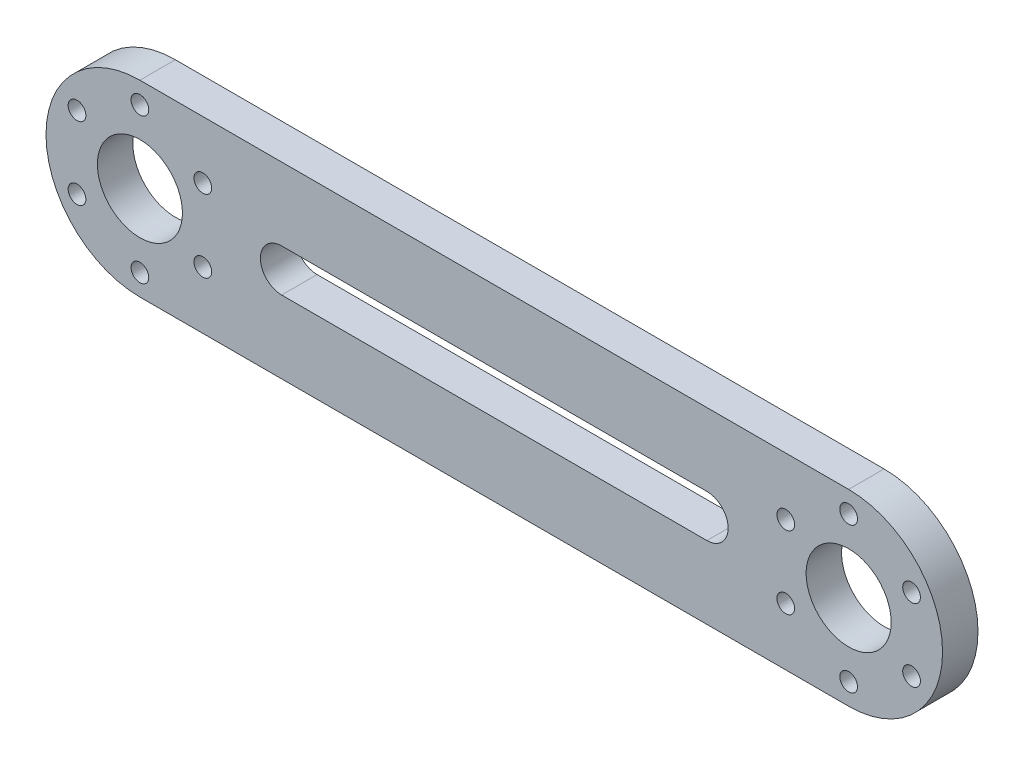
ISO-10303-21;
HEADER;
FILE_DESCRIPTION(('STEP AP214'),'2;1');
FILE_NAME('part.step','',(''),(''),'','','');
FILE_SCHEMA(('AUTOMOTIVE_DESIGN { 1 0 10303 214 1 1 1 1 }'));
ENDSEC;
DATA;
#1=APPLICATION_CONTEXT('core data for automotive mechanical design processes');
#2=APPLICATION_PROTOCOL_DEFINITION('international standard','automotive_design',2000,#1);
#3=PRODUCT_CONTEXT('',#1,'mechanical');
#4=PRODUCT('Part','Part','',(#3));
#5=PRODUCT_RELATED_PRODUCT_CATEGORY('part','',(#4));
#6=PRODUCT_DEFINITION_FORMATION('','',#4);
#7=PRODUCT_DEFINITION_CONTEXT('part definition',#1,'design');
#8=PRODUCT_DEFINITION('design','',#6,#7);
#9=PRODUCT_DEFINITION_SHAPE('','',#8);
#10=(LENGTH_UNIT() NAMED_UNIT(*) SI_UNIT(.MILLI.,.METRE.));
#11=(NAMED_UNIT(*) PLANE_ANGLE_UNIT() SI_UNIT($,.RADIAN.));
#12=(NAMED_UNIT(*) SI_UNIT($,.STERADIAN.) SOLID_ANGLE_UNIT());
#13=UNCERTAINTY_MEASURE_WITH_UNIT(LENGTH_MEASURE(1.E-05),#10,'distance_accuracy_value','');
#14=(GEOMETRIC_REPRESENTATION_CONTEXT(3) GLOBAL_UNCERTAINTY_ASSIGNED_CONTEXT((#13)) GLOBAL_UNIT_ASSIGNED_CONTEXT((#10,
#11,#12)) REPRESENTATION_CONTEXT('',''));
#15=CARTESIAN_POINT('',(0.,0.,0.));
#16=DIRECTION('',(0.,0.,1.));
#17=DIRECTION('',(1.,0.,0.));
#18=AXIS2_PLACEMENT_3D('',#15,#16,#17);
#19=CARTESIAN_POINT('',(0.,0.,4.99999999999999));
#20=DIRECTION('',(0.,0.,1.));
#21=DIRECTION('',(1.,0.,0.));
#22=AXIS2_PLACEMENT_3D('',#19,#20,#21);
#23=PLANE('',#22);
#24=CARTESIAN_POINT('',(91.1232396112095,5.12499999999991,5.00000000000005));
#25=DIRECTION('',(0.,0.,-1.));
#26=DIRECTION('',(-1.,0.,0.));
#27=AXIS2_PLACEMENT_3D('',#24,#25,#26);
#28=CIRCLE('',#27,1.25000000000001);
#29=CARTESIAN_POINT('',(89.8732396112095,5.12499999999991,5.00000000000005));
#30=VERTEX_POINT('',#29);
#31=EDGE_CURVE('E316',#30,#30,#28,.T.);
#32=ORIENTED_EDGE('',*,*,#31,.T.);
#33=EDGE_LOOP('',(#32));
#34=FACE_BOUND('',#33,.T.);
#35=CARTESIAN_POINT('',(108.876760388791,5.12499999999988,5.00000000000001));
#36=DIRECTION('',(0.,0.,1.));
#37=DIRECTION('',(1.,0.,0.));
#38=AXIS2_PLACEMENT_3D('',#35,#36,#37);
#39=CIRCLE('',#38,1.25000000000001);
#40=CARTESIAN_POINT('',(110.126760388791,5.12499999999988,5.00000000000001));
#41=VERTEX_POINT('',#40);
#42=EDGE_CURVE('E348',#41,#41,#39,.F.);
#43=ORIENTED_EDGE('',*,*,#42,.T.);
#44=EDGE_LOOP('',(#43));
#45=FACE_BOUND('',#44,.T.);
#46=CARTESIAN_POINT('',(108.876760388791,-5.12499999999991,5.));
#47=DIRECTION('',(0.,0.,-1.));
#48=DIRECTION('',(-1.,0.,0.));
#49=AXIS2_PLACEMENT_3D('',#46,#47,#48);
#50=CIRCLE('',#49,1.25000000000001);
#51=CARTESIAN_POINT('',(107.626760388791,-5.12499999999991,5.));
#52=VERTEX_POINT('',#51);
#53=EDGE_CURVE('E331',#52,#52,#50,.T.);
#54=ORIENTED_EDGE('',*,*,#53,.T.);
#55=EDGE_LOOP('',(#54));
#56=FACE_BOUND('',#55,.T.);
#57=CARTESIAN_POINT('',(100.,-10.25,5.00000000000005));
#58=DIRECTION('',(0.,0.,-1.));
#59=DIRECTION('',(-1.,0.,0.));
#60=AXIS2_PLACEMENT_3D('',#57,#58,#59);
#61=CIRCLE('',#60,1.25);
#62=CARTESIAN_POINT('',(98.75,-10.25,5.00000000000005));
#63=VERTEX_POINT('',#62);
#64=EDGE_CURVE('E458',#63,#63,#61,.T.);
#65=ORIENTED_EDGE('',*,*,#64,.T.);
#66=EDGE_LOOP('',(#65));
#67=FACE_BOUND('',#66,.T.);
#68=CARTESIAN_POINT('',(91.1232396112095,-5.12499999999991,5.00000000000001));
#69=DIRECTION('',(0.,0.,-1.));
#70=DIRECTION('',(-1.,0.,0.));
#71=AXIS2_PLACEMENT_3D('',#68,#69,#70);
#72=CIRCLE('',#71,1.25000000000001);
#73=CARTESIAN_POINT('',(89.8732396112095,-5.12499999999991,5.00000000000001));
#74=VERTEX_POINT('',#73);
#75=EDGE_CURVE('E450',#74,#74,#72,.T.);
#76=ORIENTED_EDGE('',*,*,#75,.T.);
#77=EDGE_LOOP('',(#76));
#78=FACE_BOUND('',#77,.T.);
#79=CARTESIAN_POINT('',(100.,10.25,5.00000000000003));
#80=DIRECTION('',(0.,0.,1.));
#81=DIRECTION('',(1.,0.,0.));
#82=AXIS2_PLACEMENT_3D('',#79,#80,#81);
#83=CIRCLE('',#82,1.25);
#84=CARTESIAN_POINT('',(101.25,10.25,5.00000000000003));
#85=VERTEX_POINT('',#84);
#86=EDGE_CURVE('E284',#85,#85,#83,.F.);
#87=ORIENTED_EDGE('',*,*,#86,.T.);
#88=EDGE_LOOP('',(#87));
#89=FACE_BOUND('',#88,.T.);
#90=CARTESIAN_POINT('',(0.,0.,4.99999999999999));
#91=DIRECTION('',(0.,0.,1.));
#92=DIRECTION('',(1.,0.,0.));
#93=AXIS2_PLACEMENT_3D('',#90,#91,#92);
#94=CIRCLE('',#93,6.);
#95=CARTESIAN_POINT('',(6.,0.,4.99999999999999));
#96=VERTEX_POINT('',#95);
#97=EDGE_CURVE('E190',#96,#96,#94,.T.);
#98=ORIENTED_EDGE('',*,*,#97,.F.);
#99=EDGE_LOOP('',(#98));
#100=FACE_BOUND('',#99,.T.);
#101=CARTESIAN_POINT('',(0.,0.,4.99999999999999));
#102=DIRECTION('',(0.,0.,1.));
#103=DIRECTION('',(1.,0.,0.));
#104=AXIS2_PLACEMENT_3D('',#101,#102,#103);
#105=CIRCLE('',#104,13.25);
#106=CARTESIAN_POINT('',(0.,13.25,5.));
#107=VERTEX_POINT('',#106);
#108=CARTESIAN_POINT('',(0.,-13.25,5.));
#109=VERTEX_POINT('',#108);
#110=EDGE_CURVE('E278',#107,#109,#105,.T.);
#111=ORIENTED_EDGE('',*,*,#110,.T.);
#112=DIRECTION('',(1.,0.,0.));
#113=VECTOR('',#112,1.);
#114=CARTESIAN_POINT('',(0.,-13.25,5.));
#115=LINE('',#114,#113);
#116=CARTESIAN_POINT('',(100.,-13.25,5.));
#117=VERTEX_POINT('',#116);
#118=EDGE_CURVE('E109',#109,#117,#115,.T.);
#119=ORIENTED_EDGE('',*,*,#118,.T.);
#120=CARTESIAN_POINT('',(100.,0.,5.00000000000003));
#121=DIRECTION('',(0.,0.,1.));
#122=DIRECTION('',(1.,0.,0.));
#123=AXIS2_PLACEMENT_3D('',#120,#121,#122);
#124=CIRCLE('',#123,13.25);
#125=CARTESIAN_POINT('',(100.,13.25,5.00000000000002));
#126=VERTEX_POINT('',#125);
#127=EDGE_CURVE('E289',#117,#126,#124,.T.);
#128=ORIENTED_EDGE('',*,*,#127,.T.);
#129=DIRECTION('',(1.,0.,0.));
#130=VECTOR('',#129,1.);
#131=CARTESIAN_POINT('',(0.,13.25,5.));
#132=LINE('',#131,#130);
#133=EDGE_CURVE('E223',#107,#126,#132,.T.);
#134=ORIENTED_EDGE('',*,*,#133,.F.);
#135=EDGE_LOOP('',(#111,#119,#128,#134));
#136=FACE_BOUND('',#135,.T.);
#137=CARTESIAN_POINT('',(80.,0.,5.00000000000002));
#138=DIRECTION('',(0.,0.,1.));
#139=DIRECTION('',(1.,0.,0.));
#140=AXIS2_PLACEMENT_3D('',#137,#138,#139);
#141=CIRCLE('',#140,2.99999999999999);
#142=CARTESIAN_POINT('',(80.,-2.99999999999998,5.00000000000003));
#143=VERTEX_POINT('',#142);
#144=CARTESIAN_POINT('',(80.,2.99999999999998,5.00000000000007));
#145=VERTEX_POINT('',#144);
#146=EDGE_CURVE('E138',#143,#145,#141,.T.);
#147=ORIENTED_EDGE('',*,*,#146,.F.);
#148=DIRECTION('',(1.,0.,0.));
#149=VECTOR('',#148,1.);
#150=CARTESIAN_POINT('',(0.,-3.,4.99999999999999));
#151=LINE('',#150,#149);
#152=CARTESIAN_POINT('',(20.,-3.00000000000003,5.00000000000001));
#153=VERTEX_POINT('',#152);
#154=EDGE_CURVE('E127',#153,#143,#151,.T.);
#155=ORIENTED_EDGE('',*,*,#154,.F.);
#156=CARTESIAN_POINT('',(20.,0.,5.));
#157=DIRECTION('',(0.,0.,1.));
#158=DIRECTION('',(1.,0.,0.));
#159=AXIS2_PLACEMENT_3D('',#156,#157,#158);
#160=CIRCLE('',#159,3.);
#161=CARTESIAN_POINT('',(20.,2.99999999999998,5.00000000000002));
#162=VERTEX_POINT('',#161);
#163=EDGE_CURVE('E137',#162,#153,#160,.T.);
#164=ORIENTED_EDGE('',*,*,#163,.F.);
#165=DIRECTION('',(1.,0.,0.));
#166=VECTOR('',#165,1.);
#167=CARTESIAN_POINT('',(0.,2.99999999999998,5.00000000000003));
#168=LINE('',#167,#166);
#169=EDGE_CURVE('E67',#162,#145,#168,.T.);
#170=ORIENTED_EDGE('',*,*,#169,.T.);
#171=EDGE_LOOP('',(#147,#155,#164,#170));
#172=FACE_BOUND('',#171,.T.);
#173=CARTESIAN_POINT('',(100.,0.,5.00000000000003));
#174=DIRECTION('',(0.,0.,1.));
#175=DIRECTION('',(1.,0.,0.));
#176=AXIS2_PLACEMENT_3D('',#173,#174,#175);
#177=CIRCLE('',#176,6.);
#178=CARTESIAN_POINT('',(106.,0.,5.00000000000003));
#179=VERTEX_POINT('',#178);
#180=EDGE_CURVE('E146',#179,#179,#177,.T.);
#181=ORIENTED_EDGE('',*,*,#180,.F.);
#182=EDGE_LOOP('',(#181));
#183=FACE_BOUND('',#182,.T.);
#184=CARTESIAN_POINT('',(-8.87676038879052,5.12499999999991,5.00000000000003));
#185=DIRECTION('',(0.,0.,1.));
#186=DIRECTION('',(1.,0.,0.));
#187=AXIS2_PLACEMENT_3D('',#184,#185,#186);
#188=CIRCLE('',#187,1.25);
#189=CARTESIAN_POINT('',(-7.62676038879053,5.12499999999991,5.00000000000003));
#190=VERTEX_POINT('',#189);
#191=EDGE_CURVE('E339',#190,#190,#188,.T.);
#192=ORIENTED_EDGE('',*,*,#191,.F.);
#193=EDGE_LOOP('',(#192));
#194=FACE_BOUND('',#193,.T.);
#195=CARTESIAN_POINT('',(8.87676038879057,-5.12499999999991,5.00000000000003));
#196=DIRECTION('',(0.,0.,1.));
#197=DIRECTION('',(1.,0.,0.));
#198=AXIS2_PLACEMENT_3D('',#195,#196,#197);
#199=CIRCLE('',#198,1.25);
#200=CARTESIAN_POINT('',(10.1267603887906,-5.12499999999991,5.00000000000003));
#201=VERTEX_POINT('',#200);
#202=EDGE_CURVE('E332',#201,#201,#199,.T.);
#203=ORIENTED_EDGE('',*,*,#202,.F.);
#204=EDGE_LOOP('',(#203));
#205=FACE_BOUND('',#204,.T.);
#206=CARTESIAN_POINT('',(8.87676038879057,5.12499999999991,5.00000000000002));
#207=DIRECTION('',(0.,0.,1.));
#208=DIRECTION('',(1.,0.,0.));
#209=AXIS2_PLACEMENT_3D('',#206,#207,#208);
#210=CIRCLE('',#209,1.25);
#211=CARTESIAN_POINT('',(10.1267603887906,5.12499999999991,5.00000000000002));
#212=VERTEX_POINT('',#211);
#213=EDGE_CURVE('E354',#212,#212,#210,.T.);
#214=ORIENTED_EDGE('',*,*,#213,.F.);
#215=EDGE_LOOP('',(#214));
#216=FACE_BOUND('',#215,.T.);
#217=CARTESIAN_POINT('',(-8.87676038879057,-5.12499999999991,5.00000000000001));
#218=DIRECTION('',(0.,0.,1.));
#219=DIRECTION('',(1.,0.,0.));
#220=AXIS2_PLACEMENT_3D('',#217,#218,#219);
#221=CIRCLE('',#220,1.25);
#222=CARTESIAN_POINT('',(-7.62676038879057,-5.12499999999991,5.00000000000001));
#223=VERTEX_POINT('',#222);
#224=EDGE_CURVE('E347',#223,#223,#221,.T.);
#225=ORIENTED_EDGE('',*,*,#224,.F.);
#226=EDGE_LOOP('',(#225));
#227=FACE_BOUND('',#226,.T.);
#228=CARTESIAN_POINT('',(0.,-10.25,5.));
#229=DIRECTION('',(0.,0.,1.));
#230=DIRECTION('',(1.,0.,0.));
#231=AXIS2_PLACEMENT_3D('',#228,#229,#230);
#232=CIRCLE('',#231,1.25);
#233=CARTESIAN_POINT('',(1.24999999999994,-10.25,5.));
#234=VERTEX_POINT('',#233);
#235=EDGE_CURVE('E433',#234,#234,#232,.T.);
#236=ORIENTED_EDGE('',*,*,#235,.F.);
#237=EDGE_LOOP('',(#236));
#238=FACE_BOUND('',#237,.T.);
#239=CARTESIAN_POINT('',(0.,10.25,5.));
#240=DIRECTION('',(0.,0.,1.));
#241=DIRECTION('',(1.,0.,0.));
#242=AXIS2_PLACEMENT_3D('',#239,#240,#241);
#243=CIRCLE('',#242,1.25);
#244=CARTESIAN_POINT('',(1.25,10.25,5.));
#245=VERTEX_POINT('',#244);
#246=EDGE_CURVE('E315',#245,#245,#243,.T.);
#247=ORIENTED_EDGE('',*,*,#246,.F.);
#248=EDGE_LOOP('',(#247));
#249=FACE_BOUND('',#248,.T.);
#250=ADVANCED_FACE('F47',(#34,#45,#56,#67,#78,#89,#100,#136,#172,#183,#194,#205,#216,#227,#238,
#249),#23,.T.);
#251=CARTESIAN_POINT('',(0.,0.,0.));
#252=DIRECTION('',(0.,0.,1.));
#253=DIRECTION('',(1.,0.,0.));
#254=AXIS2_PLACEMENT_3D('',#251,#252,#253);
#255=PLANE('',#254);
#256=CARTESIAN_POINT('',(91.1232396112094,5.12499999999988,0.));
#257=DIRECTION('',(0.,0.,-1.));
#258=DIRECTION('',(-1.,0.,0.));
#259=AXIS2_PLACEMENT_3D('',#256,#257,#258);
#260=CIRCLE('',#259,1.25000000000001);
#261=CARTESIAN_POINT('',(89.8732396112094,5.12499999999988,0.));
#262=VERTEX_POINT('',#261);
#263=EDGE_CURVE('E324',#262,#262,#260,.T.);
#264=ORIENTED_EDGE('',*,*,#263,.F.);
#265=EDGE_LOOP('',(#264));
#266=FACE_BOUND('',#265,.T.);
#267=CARTESIAN_POINT('',(0.,-10.25,0.));
#268=DIRECTION('',(0.,0.,1.));
#269=DIRECTION('',(1.,0.,0.));
#270=AXIS2_PLACEMENT_3D('',#267,#268,#269);
#271=CIRCLE('',#270,1.25);
#272=CARTESIAN_POINT('',(1.25,-10.25,0.));
#273=VERTEX_POINT('',#272);
#274=EDGE_CURVE('E322',#273,#273,#271,.T.);
#275=ORIENTED_EDGE('',*,*,#274,.T.);
#276=EDGE_LOOP('',(#275));
#277=FACE_BOUND('',#276,.T.);
#278=CARTESIAN_POINT('',(8.87676038879055,5.12499999999991,0.));
#279=DIRECTION('',(0.,0.,1.));
#280=DIRECTION('',(1.,0.,0.));
#281=AXIS2_PLACEMENT_3D('',#278,#279,#280);
#282=CIRCLE('',#281,1.25);
#283=CARTESIAN_POINT('',(10.1267603887906,5.12499999999991,0.));
#284=VERTEX_POINT('',#283);
#285=EDGE_CURVE('E336',#284,#284,#282,.T.);
#286=ORIENTED_EDGE('',*,*,#285,.T.);
#287=EDGE_LOOP('',(#286));
#288=FACE_BOUND('',#287,.T.);
#289=CARTESIAN_POINT('',(-8.87676038879054,5.12499999999991,0.));
#290=DIRECTION('',(0.,0.,1.));
#291=DIRECTION('',(1.,0.,0.));
#292=AXIS2_PLACEMENT_3D('',#289,#290,#291);
#293=CIRCLE('',#292,1.25);
#294=CARTESIAN_POINT('',(-7.62676038879054,5.12499999999991,0.));
#295=VERTEX_POINT('',#294);
#296=EDGE_CURVE('E343',#295,#295,#293,.T.);
#297=ORIENTED_EDGE('',*,*,#296,.T.);
#298=EDGE_LOOP('',(#297));
#299=FACE_BOUND('',#298,.T.);
#300=CARTESIAN_POINT('',(108.87676038879,-5.12499999999991,0.));
#301=DIRECTION('',(0.,0.,-1.));
#302=DIRECTION('',(-1.,0.,0.));
#303=AXIS2_PLACEMENT_3D('',#300,#301,#302);
#304=CIRCLE('',#303,1.25000000000001);
#305=CARTESIAN_POINT('',(107.62676038879,-5.12499999999991,0.));
#306=VERTEX_POINT('',#305);
#307=EDGE_CURVE('E462',#306,#306,#304,.T.);
#308=ORIENTED_EDGE('',*,*,#307,.F.);
#309=EDGE_LOOP('',(#308));
#310=FACE_BOUND('',#309,.T.);
#311=CARTESIAN_POINT('',(100.,-10.25,0.));
#312=DIRECTION('',(0.,0.,-1.));
#313=DIRECTION('',(-1.,0.,0.));
#314=AXIS2_PLACEMENT_3D('',#311,#312,#313);
#315=CIRCLE('',#314,1.25);
#316=CARTESIAN_POINT('',(98.75,-10.25,0.));
#317=VERTEX_POINT('',#316);
#318=EDGE_CURVE('E454',#317,#317,#315,.T.);
#319=ORIENTED_EDGE('',*,*,#318,.F.);
#320=EDGE_LOOP('',(#319));
#321=FACE_BOUND('',#320,.T.);
#322=CARTESIAN_POINT('',(91.1232396112096,-5.12499999999988,0.));
#323=DIRECTION('',(0.,0.,-1.));
#324=DIRECTION('',(-1.,0.,0.));
#325=AXIS2_PLACEMENT_3D('',#322,#323,#324);
#326=CIRCLE('',#325,1.25000000000001);
#327=CARTESIAN_POINT('',(89.8732396112096,-5.12499999999988,0.));
#328=VERTEX_POINT('',#327);
#329=EDGE_CURVE('E447',#328,#328,#326,.T.);
#330=ORIENTED_EDGE('',*,*,#329,.F.);
#331=EDGE_LOOP('',(#330));
#332=FACE_BOUND('',#331,.T.);
#333=CARTESIAN_POINT('',(100.,10.25,0.));
#334=DIRECTION('',(0.,0.,1.));
#335=DIRECTION('',(1.,0.,0.));
#336=AXIS2_PLACEMENT_3D('',#333,#334,#335);
#337=CIRCLE('',#336,1.25);
#338=CARTESIAN_POINT('',(101.25,10.25,0.));
#339=VERTEX_POINT('',#338);
#340=EDGE_CURVE('E159',#339,#339,#337,.F.);
#341=ORIENTED_EDGE('',*,*,#340,.F.);
#342=EDGE_LOOP('',(#341));
#343=FACE_BOUND('',#342,.T.);
#344=CARTESIAN_POINT('',(0.,0.,0.));
#345=DIRECTION('',(0.,0.,1.));
#346=DIRECTION('',(1.,0.,0.));
#347=AXIS2_PLACEMENT_3D('',#344,#345,#346);
#348=CIRCLE('',#347,6.);
#349=CARTESIAN_POINT('',(6.,0.,0.));
#350=VERTEX_POINT('',#349);
#351=EDGE_CURVE('E154',#350,#350,#348,.T.);
#352=ORIENTED_EDGE('',*,*,#351,.T.);
#353=EDGE_LOOP('',(#352));
#354=FACE_BOUND('',#353,.T.);
#355=CARTESIAN_POINT('',(0.,0.,0.));
#356=DIRECTION('',(0.,0.,1.));
#357=DIRECTION('',(1.,0.,0.));
#358=AXIS2_PLACEMENT_3D('',#355,#356,#357);
#359=CIRCLE('',#358,13.25);
#360=CARTESIAN_POINT('',(0.,13.25,0.));
#361=VERTEX_POINT('',#360);
#362=CARTESIAN_POINT('',(0.,-13.25,0.));
#363=VERTEX_POINT('',#362);
#364=EDGE_CURVE('E158',#361,#363,#359,.T.);
#365=ORIENTED_EDGE('',*,*,#364,.F.);
#366=DIRECTION('',(1.,0.,0.));
#367=VECTOR('',#366,1.);
#368=CARTESIAN_POINT('',(0.,13.25,0.));
#369=LINE('',#368,#367);
#370=CARTESIAN_POINT('',(100.,13.25,0.));
#371=VERTEX_POINT('',#370);
#372=EDGE_CURVE('E170',#361,#371,#369,.T.);
#373=ORIENTED_EDGE('',*,*,#372,.T.);
#374=CARTESIAN_POINT('',(100.,0.,0.));
#375=DIRECTION('',(0.,0.,1.));
#376=DIRECTION('',(1.,0.,0.));
#377=AXIS2_PLACEMENT_3D('',#374,#375,#376);
#378=CIRCLE('',#377,13.25);
#379=CARTESIAN_POINT('',(100.,-13.25,0.));
#380=VERTEX_POINT('',#379);
#381=EDGE_CURVE('E166',#380,#371,#378,.T.);
#382=ORIENTED_EDGE('',*,*,#381,.F.);
#383=DIRECTION('',(1.,0.,0.));
#384=VECTOR('',#383,1.);
#385=CARTESIAN_POINT('',(0.,-13.25,0.));
#386=LINE('',#385,#384);
#387=EDGE_CURVE('E163',#363,#380,#386,.T.);
#388=ORIENTED_EDGE('',*,*,#387,.F.);
#389=EDGE_LOOP('',(#365,#373,#382,#388));
#390=FACE_BOUND('',#389,.T.);
#391=CARTESIAN_POINT('',(80.,0.,0.));
#392=DIRECTION('',(0.,0.,1.));
#393=DIRECTION('',(1.,0.,0.));
#394=AXIS2_PLACEMENT_3D('',#391,#392,#393);
#395=CIRCLE('',#394,2.99999999999999);
#396=CARTESIAN_POINT('',(80.,-2.99999999999998,0.));
#397=VERTEX_POINT('',#396);
#398=CARTESIAN_POINT('',(80.,3.00000000000003,0.));
#399=VERTEX_POINT('',#398);
#400=EDGE_CURVE('E174',#397,#399,#395,.T.);
#401=ORIENTED_EDGE('',*,*,#400,.T.);
#402=DIRECTION('',(1.,0.,0.));
#403=VECTOR('',#402,1.);
#404=CARTESIAN_POINT('',(0.,2.99999999999998,0.));
#405=LINE('',#404,#403);
#406=CARTESIAN_POINT('',(20.,3.,0.));
#407=VERTEX_POINT('',#406);
#408=EDGE_CURVE('E183',#407,#399,#405,.T.);
#409=ORIENTED_EDGE('',*,*,#408,.F.);
#410=CARTESIAN_POINT('',(20.,0.,0.));
#411=DIRECTION('',(0.,0.,1.));
#412=DIRECTION('',(1.,0.,0.));
#413=AXIS2_PLACEMENT_3D('',#410,#411,#412);
#414=CIRCLE('',#413,3.);
#415=CARTESIAN_POINT('',(20.,-3.00000000000003,0.));
#416=VERTEX_POINT('',#415);
#417=EDGE_CURVE('E180',#407,#416,#414,.T.);
#418=ORIENTED_EDGE('',*,*,#417,.T.);
#419=DIRECTION('',(1.,0.,0.));
#420=VECTOR('',#419,1.);
#421=CARTESIAN_POINT('',(0.,-3.00000000000003,0.));
#422=LINE('',#421,#420);
#423=EDGE_CURVE('E129',#416,#397,#422,.T.);
#424=ORIENTED_EDGE('',*,*,#423,.T.);
#425=EDGE_LOOP('',(#401,#409,#418,#424));
#426=FACE_BOUND('',#425,.T.);
#427=CARTESIAN_POINT('',(100.,0.,0.));
#428=DIRECTION('',(0.,0.,1.));
#429=DIRECTION('',(1.,0.,0.));
#430=AXIS2_PLACEMENT_3D('',#427,#428,#429);
#431=CIRCLE('',#430,6.);
#432=CARTESIAN_POINT('',(106.,0.,0.));
#433=VERTEX_POINT('',#432);
#434=EDGE_CURVE('E186',#433,#433,#431,.T.);
#435=ORIENTED_EDGE('',*,*,#434,.T.);
#436=EDGE_LOOP('',(#435));
#437=FACE_BOUND('',#436,.T.);
#438=CARTESIAN_POINT('',(8.87676038879065,-5.12499999999991,0.));
#439=DIRECTION('',(0.,0.,1.));
#440=DIRECTION('',(1.,0.,0.));
#441=AXIS2_PLACEMENT_3D('',#438,#439,#440);
#442=CIRCLE('',#441,1.25);
#443=CARTESIAN_POINT('',(10.1267603887906,-5.12499999999991,0.));
#444=VERTEX_POINT('',#443);
#445=EDGE_CURVE('E301',#444,#444,#442,.T.);
#446=ORIENTED_EDGE('',*,*,#445,.T.);
#447=EDGE_LOOP('',(#446));
#448=FACE_BOUND('',#447,.T.);
#449=CARTESIAN_POINT('',(108.876760388791,5.12499999999991,0.));
#450=DIRECTION('',(0.,0.,1.));
#451=DIRECTION('',(1.,0.,0.));
#452=AXIS2_PLACEMENT_3D('',#449,#450,#451);
#453=CIRCLE('',#452,1.25000000000001);
#454=CARTESIAN_POINT('',(110.126760388791,5.12499999999991,0.));
#455=VERTEX_POINT('',#454);
#456=EDGE_CURVE('E305',#455,#455,#453,.F.);
#457=ORIENTED_EDGE('',*,*,#456,.F.);
#458=EDGE_LOOP('',(#457));
#459=FACE_BOUND('',#458,.T.);
#460=CARTESIAN_POINT('',(-8.87676038879055,-5.12499999999991,0.));
#461=DIRECTION('',(0.,0.,1.));
#462=DIRECTION('',(1.,0.,0.));
#463=AXIS2_PLACEMENT_3D('',#460,#461,#462);
#464=CIRCLE('',#463,1.25);
#465=CARTESIAN_POINT('',(-7.62676038879055,-5.12499999999991,0.));
#466=VERTEX_POINT('',#465);
#467=EDGE_CURVE('E309',#466,#466,#464,.T.);
#468=ORIENTED_EDGE('',*,*,#467,.T.);
#469=EDGE_LOOP('',(#468));
#470=FACE_BOUND('',#469,.T.);
#471=CARTESIAN_POINT('',(0.,10.25,0.));
#472=DIRECTION('',(0.,0.,1.));
#473=DIRECTION('',(1.,0.,0.));
#474=AXIS2_PLACEMENT_3D('',#471,#472,#473);
#475=CIRCLE('',#474,1.25);
#476=CARTESIAN_POINT('',(1.25000000000006,10.25,0.));
#477=VERTEX_POINT('',#476);
#478=EDGE_CURVE('E312',#477,#477,#475,.T.);
#479=ORIENTED_EDGE('',*,*,#478,.T.);
#480=EDGE_LOOP('',(#479));
#481=FACE_BOUND('',#480,.T.);
#482=ADVANCED_FACE('F216',(#266,#277,#288,#299,#310,#321,#332,#343,#354,#390,#426,#437,#448,
#459,#470,#481),#255,.F.);
#483=CARTESIAN_POINT('',(80.,0.,5.00000000000002));
#484=DIRECTION('',(0.,0.,-1.));
#485=DIRECTION('',(-1.,0.,0.));
#486=AXIS2_PLACEMENT_3D('',#483,#484,#485);
#487=CYLINDRICAL_SURFACE('',#486,2.99999999999999);
#488=ORIENTED_EDGE('',*,*,#400,.F.);
#489=DIRECTION('',(0.,0.,-1.));
#490=VECTOR('',#489,1.);
#491=CARTESIAN_POINT('',(80.,-2.99999999999998,5.00000000000003));
#492=LINE('',#491,#490);
#493=EDGE_CURVE('E11',#143,#397,#492,.T.);
#494=ORIENTED_EDGE('',*,*,#493,.F.);
#495=ORIENTED_EDGE('',*,*,#146,.T.);
#496=DIRECTION('',(0.,0.,-1.));
#497=VECTOR('',#496,1.);
#498=CARTESIAN_POINT('',(80.,2.99999999999998,5.00000000000007));
#499=LINE('',#498,#497);
#500=EDGE_CURVE('E101',#145,#399,#499,.T.);
#501=ORIENTED_EDGE('',*,*,#500,.T.);
#502=EDGE_LOOP('',(#488,#494,#495,#501));
#503=FACE_BOUND('',#502,.T.);
#504=ADVANCED_FACE('F244',(#503),#487,.F.);
#505=CARTESIAN_POINT('',(0.,-3.,4.99999999999999));
#506=DIRECTION('',(0.,0.999999999999999,0.));
#507=DIRECTION('',(0.,0.,1.));
#508=AXIS2_PLACEMENT_3D('',#505,#506,#507);
#509=PLANE('',#508);
#510=ORIENTED_EDGE('',*,*,#423,.F.);
#511=DIRECTION('',(0.,0.,-1.));
#512=VECTOR('',#511,1.);
#513=CARTESIAN_POINT('',(20.,-3.00000000000003,5.00000000000001));
#514=LINE('',#513,#512);
#515=EDGE_CURVE('E58',#153,#416,#514,.T.);
#516=ORIENTED_EDGE('',*,*,#515,.F.);
#517=ORIENTED_EDGE('',*,*,#154,.T.);
#518=ORIENTED_EDGE('',*,*,#493,.T.);
#519=EDGE_LOOP('',(#510,#516,#517,#518));
#520=FACE_BOUND('',#519,.T.);
#521=ADVANCED_FACE('F126',(#520),#509,.T.);
#522=CARTESIAN_POINT('',(20.,0.,5.));
#523=DIRECTION('',(0.,0.,-1.));
#524=DIRECTION('',(-1.,0.,0.));
#525=AXIS2_PLACEMENT_3D('',#522,#523,#524);
#526=CYLINDRICAL_SURFACE('',#525,3.);
#527=ORIENTED_EDGE('',*,*,#417,.F.);
#528=DIRECTION('',(0.,0.,-1.));
#529=VECTOR('',#528,1.);
#530=CARTESIAN_POINT('',(20.,2.99999999999998,5.00000000000002));
#531=LINE('',#530,#529);
#532=EDGE_CURVE('E94',#162,#407,#531,.T.);
#533=ORIENTED_EDGE('',*,*,#532,.F.);
#534=ORIENTED_EDGE('',*,*,#163,.T.);
#535=ORIENTED_EDGE('',*,*,#515,.T.);
#536=EDGE_LOOP('',(#527,#533,#534,#535));
#537=FACE_BOUND('',#536,.T.);
#538=ADVANCED_FACE('F141',(#537),#526,.F.);
#539=CARTESIAN_POINT('',(0.,0.,4.99999999999999));
#540=DIRECTION('',(0.,0.,-1.));
#541=DIRECTION('',(-1.,0.,0.));
#542=AXIS2_PLACEMENT_3D('',#539,#540,#541);
#543=CYLINDRICAL_SURFACE('',#542,13.25);
#544=ORIENTED_EDGE('',*,*,#364,.T.);
#545=DIRECTION('',(0.,0.,-1.));
#546=VECTOR('',#545,1.);
#547=CARTESIAN_POINT('',(0.,-13.25,5.));
#548=LINE('',#547,#546);
#549=EDGE_CURVE('E51',#109,#363,#548,.T.);
#550=ORIENTED_EDGE('',*,*,#549,.F.);
#551=ORIENTED_EDGE('',*,*,#110,.F.);
#552=DIRECTION('',(0.,0.,-1.));
#553=VECTOR('',#552,1.);
#554=CARTESIAN_POINT('',(0.,13.25,5.));
#555=LINE('',#554,#553);
#556=EDGE_CURVE('E153',#107,#361,#555,.T.);
#557=ORIENTED_EDGE('',*,*,#556,.T.);
#558=EDGE_LOOP('',(#544,#550,#551,#557));
#559=FACE_BOUND('',#558,.T.);
#560=ADVANCED_FACE('F213',(#559),#543,.T.);
#561=CARTESIAN_POINT('',(0.,-13.25,5.));
#562=DIRECTION('',(0.,0.999999999999999,0.));
#563=DIRECTION('',(0.,0.,1.));
#564=AXIS2_PLACEMENT_3D('',#561,#562,#563);
#565=PLANE('',#564);
#566=ORIENTED_EDGE('',*,*,#387,.T.);
#567=DIRECTION('',(0.,0.,-1.));
#568=VECTOR('',#567,1.);
#569=CARTESIAN_POINT('',(100.,-13.25,5.));
#570=LINE('',#569,#568);
#571=EDGE_CURVE('E199',#117,#380,#570,.T.);
#572=ORIENTED_EDGE('',*,*,#571,.F.);
#573=ORIENTED_EDGE('',*,*,#118,.F.);
#574=ORIENTED_EDGE('',*,*,#549,.T.);
#575=EDGE_LOOP('',(#566,#572,#573,#574));
#576=FACE_BOUND('',#575,.T.);
#577=ADVANCED_FACE('F209',(#576),#565,.F.);
#578=CARTESIAN_POINT('',(100.,0.,5.00000000000003));
#579=DIRECTION('',(0.,0.,-1.));
#580=DIRECTION('',(-1.,0.,0.));
#581=AXIS2_PLACEMENT_3D('',#578,#579,#580);
#582=CYLINDRICAL_SURFACE('',#581,13.25);
#583=ORIENTED_EDGE('',*,*,#381,.T.);
#584=DIRECTION('',(0.,0.,-1.));
#585=VECTOR('',#584,1.);
#586=CARTESIAN_POINT('',(100.,13.25,5.00000000000002));
#587=LINE('',#586,#585);
#588=EDGE_CURVE('E197',#126,#371,#587,.T.);
#589=ORIENTED_EDGE('',*,*,#588,.F.);
#590=ORIENTED_EDGE('',*,*,#127,.F.);
#591=ORIENTED_EDGE('',*,*,#571,.T.);
#592=EDGE_LOOP('',(#583,#589,#590,#591));
#593=FACE_BOUND('',#592,.T.);
#594=ADVANCED_FACE('F224',(#593),#582,.T.);
#595=CARTESIAN_POINT('',(0.,2.99999999999998,5.00000000000003));
#596=DIRECTION('',(0.,0.999999999999999,0.));
#597=DIRECTION('',(-1.,0.,0.));
#598=AXIS2_PLACEMENT_3D('',#595,#596,#597);
#599=PLANE('',#598);
#600=ORIENTED_EDGE('',*,*,#408,.T.);
#601=ORIENTED_EDGE('',*,*,#500,.F.);
#602=ORIENTED_EDGE('',*,*,#169,.F.);
#603=ORIENTED_EDGE('',*,*,#532,.T.);
#604=EDGE_LOOP('',(#600,#601,#602,#603));
#605=FACE_BOUND('',#604,.T.);
#606=ADVANCED_FACE('F226',(#605),#599,.F.);
#607=CARTESIAN_POINT('',(0.,13.25,5.));
#608=DIRECTION('',(0.,0.999999999999999,0.));
#609=DIRECTION('',(0.,0.,1.));
#610=AXIS2_PLACEMENT_3D('',#607,#608,#609);
#611=PLANE('',#610);
#612=ORIENTED_EDGE('',*,*,#372,.F.);
#613=ORIENTED_EDGE('',*,*,#556,.F.);
#614=ORIENTED_EDGE('',*,*,#133,.T.);
#615=ORIENTED_EDGE('',*,*,#588,.T.);
#616=EDGE_LOOP('',(#612,#613,#614,#615));
#617=FACE_BOUND('',#616,.T.);
#618=ADVANCED_FACE('F219',(#617),#611,.T.);
#619=CARTESIAN_POINT('',(0.,0.,4.99999999999999));
#620=DIRECTION('',(0.,0.,-1.));
#621=DIRECTION('',(-1.,0.,0.));
#622=AXIS2_PLACEMENT_3D('',#619,#620,#621);
#623=CYLINDRICAL_SURFACE('',#622,6.);
#624=ORIENTED_EDGE('',*,*,#97,.T.);
#625=EDGE_LOOP('',(#624));
#626=FACE_BOUND('',#625,.T.);
#627=ORIENTED_EDGE('',*,*,#351,.F.);
#628=EDGE_LOOP('',(#627));
#629=FACE_BOUND('',#628,.T.);
#630=ADVANCED_FACE('F49',(#626,#629),#623,.F.);
#631=CARTESIAN_POINT('',(100.,0.,5.00000000000003));
#632=DIRECTION('',(0.,0.,-1.));
#633=DIRECTION('',(-1.,0.,0.));
#634=AXIS2_PLACEMENT_3D('',#631,#632,#633);
#635=CYLINDRICAL_SURFACE('',#634,6.);
#636=ORIENTED_EDGE('',*,*,#180,.T.);
#637=EDGE_LOOP('',(#636));
#638=FACE_BOUND('',#637,.T.);
#639=ORIENTED_EDGE('',*,*,#434,.F.);
#640=EDGE_LOOP('',(#639));
#641=FACE_BOUND('',#640,.T.);
#642=ADVANCED_FACE('F253',(#638,#641),#635,.F.);
#643=CARTESIAN_POINT('',(100.,10.25,0.));
#644=DIRECTION('',(0.,0.,1.));
#645=DIRECTION('',(1.,0.,0.));
#646=AXIS2_PLACEMENT_3D('',#643,#644,#645);
#647=CYLINDRICAL_SURFACE('',#646,1.25);
#648=ORIENTED_EDGE('',*,*,#340,.T.);
#649=EDGE_LOOP('',(#648));
#650=FACE_BOUND('',#649,.T.);
#651=ORIENTED_EDGE('',*,*,#86,.F.);
#652=EDGE_LOOP('',(#651));
#653=FACE_BOUND('',#652,.T.);
#654=ADVANCED_FACE('F250',(#650,#653),#647,.F.);
#655=CARTESIAN_POINT('',(91.1232396112096,-5.12499999999988,0.));
#656=DIRECTION('',(0.,0.,1.));
#657=DIRECTION('',(1.,0.,0.));
#658=AXIS2_PLACEMENT_3D('',#655,#656,#657);
#659=CYLINDRICAL_SURFACE('',#658,1.25000000000001);
#660=ORIENTED_EDGE('',*,*,#329,.T.);
#661=EDGE_LOOP('',(#660));
#662=FACE_BOUND('',#661,.T.);
#663=ORIENTED_EDGE('',*,*,#75,.F.);
#664=EDGE_LOOP('',(#663));
#665=FACE_BOUND('',#664,.T.);
#666=ADVANCED_FACE('F371',(#662,#665),#659,.F.);
#667=CARTESIAN_POINT('',(100.,-10.25,0.));
#668=DIRECTION('',(0.,0.,1.));
#669=DIRECTION('',(1.,0.,0.));
#670=AXIS2_PLACEMENT_3D('',#667,#668,#669);
#671=CYLINDRICAL_SURFACE('',#670,1.25);
#672=ORIENTED_EDGE('',*,*,#318,.T.);
#673=EDGE_LOOP('',(#672));
#674=FACE_BOUND('',#673,.T.);
#675=ORIENTED_EDGE('',*,*,#64,.F.);
#676=EDGE_LOOP('',(#675));
#677=FACE_BOUND('',#676,.T.);
#678=ADVANCED_FACE('F376',(#674,#677),#671,.F.);
#679=CARTESIAN_POINT('',(108.87676038879,-5.12499999999991,0.));
#680=DIRECTION('',(0.,0.,1.));
#681=DIRECTION('',(1.,0.,0.));
#682=AXIS2_PLACEMENT_3D('',#679,#680,#681);
#683=CYLINDRICAL_SURFACE('',#682,1.25000000000001);
#684=ORIENTED_EDGE('',*,*,#307,.T.);
#685=EDGE_LOOP('',(#684));
#686=FACE_BOUND('',#685,.T.);
#687=ORIENTED_EDGE('',*,*,#53,.F.);
#688=EDGE_LOOP('',(#687));
#689=FACE_BOUND('',#688,.T.);
#690=ADVANCED_FACE('F383',(#686,#689),#683,.F.);
#691=CARTESIAN_POINT('',(-8.87676038879054,5.12499999999991,0.));
#692=DIRECTION('',(0.,0.,1.));
#693=DIRECTION('',(1.,0.,0.));
#694=AXIS2_PLACEMENT_3D('',#691,#692,#693);
#695=CYLINDRICAL_SURFACE('',#694,1.25);
#696=ORIENTED_EDGE('',*,*,#296,.F.);
#697=EDGE_LOOP('',(#696));
#698=FACE_BOUND('',#697,.T.);
#699=ORIENTED_EDGE('',*,*,#191,.T.);
#700=EDGE_LOOP('',(#699));
#701=FACE_BOUND('',#700,.T.);
#702=ADVANCED_FACE('F410',(#698,#701),#695,.F.);
#703=CARTESIAN_POINT('',(8.87676038879065,-5.12499999999991,0.));
#704=DIRECTION('',(0.,0.,1.));
#705=DIRECTION('',(1.,0.,0.));
#706=AXIS2_PLACEMENT_3D('',#703,#704,#705);
#707=CYLINDRICAL_SURFACE('',#706,1.25);
#708=ORIENTED_EDGE('',*,*,#445,.F.);
#709=EDGE_LOOP('',(#708));
#710=FACE_BOUND('',#709,.T.);
#711=ORIENTED_EDGE('',*,*,#202,.T.);
#712=EDGE_LOOP('',(#711));
#713=FACE_BOUND('',#712,.T.);
#714=ADVANCED_FACE('F406',(#710,#713),#707,.F.);
#715=CARTESIAN_POINT('',(8.87676038879055,5.12499999999991,0.));
#716=DIRECTION('',(0.,0.,1.));
#717=DIRECTION('',(1.,0.,0.));
#718=AXIS2_PLACEMENT_3D('',#715,#716,#717);
#719=CYLINDRICAL_SURFACE('',#718,1.25);
#720=ORIENTED_EDGE('',*,*,#285,.F.);
#721=EDGE_LOOP('',(#720));
#722=FACE_BOUND('',#721,.T.);
#723=ORIENTED_EDGE('',*,*,#213,.T.);
#724=EDGE_LOOP('',(#723));
#725=FACE_BOUND('',#724,.T.);
#726=ADVANCED_FACE('F409',(#722,#725),#719,.F.);
#727=CARTESIAN_POINT('',(108.876760388791,5.12499999999991,0.));
#728=DIRECTION('',(0.,0.,1.));
#729=DIRECTION('',(1.,0.,0.));
#730=AXIS2_PLACEMENT_3D('',#727,#728,#729);
#731=CYLINDRICAL_SURFACE('',#730,1.25000000000001);
#732=ORIENTED_EDGE('',*,*,#456,.T.);
#733=EDGE_LOOP('',(#732));
#734=FACE_BOUND('',#733,.T.);
#735=ORIENTED_EDGE('',*,*,#42,.F.);
#736=EDGE_LOOP('',(#735));
#737=FACE_BOUND('',#736,.T.);
#738=ADVANCED_FACE('F394',(#734,#737),#731,.F.);
#739=CARTESIAN_POINT('',(-8.87676038879055,-5.12499999999991,0.));
#740=DIRECTION('',(0.,0.,1.));
#741=DIRECTION('',(1.,0.,0.));
#742=AXIS2_PLACEMENT_3D('',#739,#740,#741);
#743=CYLINDRICAL_SURFACE('',#742,1.25);
#744=ORIENTED_EDGE('',*,*,#467,.F.);
#745=EDGE_LOOP('',(#744));
#746=FACE_BOUND('',#745,.T.);
#747=ORIENTED_EDGE('',*,*,#224,.T.);
#748=EDGE_LOOP('',(#747));
#749=FACE_BOUND('',#748,.T.);
#750=ADVANCED_FACE('F390',(#746,#749),#743,.F.);
#751=CARTESIAN_POINT('',(0.,-10.25,0.));
#752=DIRECTION('',(0.,0.,1.));
#753=DIRECTION('',(1.,0.,0.));
#754=AXIS2_PLACEMENT_3D('',#751,#752,#753);
#755=CYLINDRICAL_SURFACE('',#754,1.25);
#756=ORIENTED_EDGE('',*,*,#274,.F.);
#757=EDGE_LOOP('',(#756));
#758=FACE_BOUND('',#757,.T.);
#759=ORIENTED_EDGE('',*,*,#235,.T.);
#760=EDGE_LOOP('',(#759));
#761=FACE_BOUND('',#760,.T.);
#762=ADVANCED_FACE('F393',(#758,#761),#755,.F.);
#763=CARTESIAN_POINT('',(0.,10.25,0.));
#764=DIRECTION('',(0.,0.,1.));
#765=DIRECTION('',(1.,0.,0.));
#766=AXIS2_PLACEMENT_3D('',#763,#764,#765);
#767=CYLINDRICAL_SURFACE('',#766,1.25);
#768=ORIENTED_EDGE('',*,*,#478,.F.);
#769=EDGE_LOOP('',(#768));
#770=FACE_BOUND('',#769,.T.);
#771=ORIENTED_EDGE('',*,*,#246,.T.);
#772=EDGE_LOOP('',(#771));
#773=FACE_BOUND('',#772,.T.);
#774=ADVANCED_FACE('F398',(#770,#773),#767,.F.);
#775=CARTESIAN_POINT('',(91.1232396112094,5.12499999999988,0.));
#776=DIRECTION('',(0.,0.,1.));
#777=DIRECTION('',(1.,0.,0.));
#778=AXIS2_PLACEMENT_3D('',#775,#776,#777);
#779=CYLINDRICAL_SURFACE('',#778,1.25000000000001);
#780=ORIENTED_EDGE('',*,*,#263,.T.);
#781=EDGE_LOOP('',(#780));
#782=FACE_BOUND('',#781,.T.);
#783=ORIENTED_EDGE('',*,*,#31,.F.);
#784=EDGE_LOOP('',(#783));
#785=FACE_BOUND('',#784,.T.);
#786=ADVANCED_FACE('F402',(#782,#785),#779,.F.);
#787=CLOSED_SHELL('',(#250,#482,#504,#521,#538,#560,#577,#594,#606,#618,#630,#642,#654,#666,
#678,#690,#702,#714,#726,#738,#750,#762,#774,#786));
#788=MANIFOLD_SOLID_BREP('B2',#787);
#789=ADVANCED_BREP_SHAPE_REPRESENTATION('',(#18,#788),#14);
#790=SHAPE_DEFINITION_REPRESENTATION(#9,#789);
ENDSEC;
END-ISO-10303-21;
